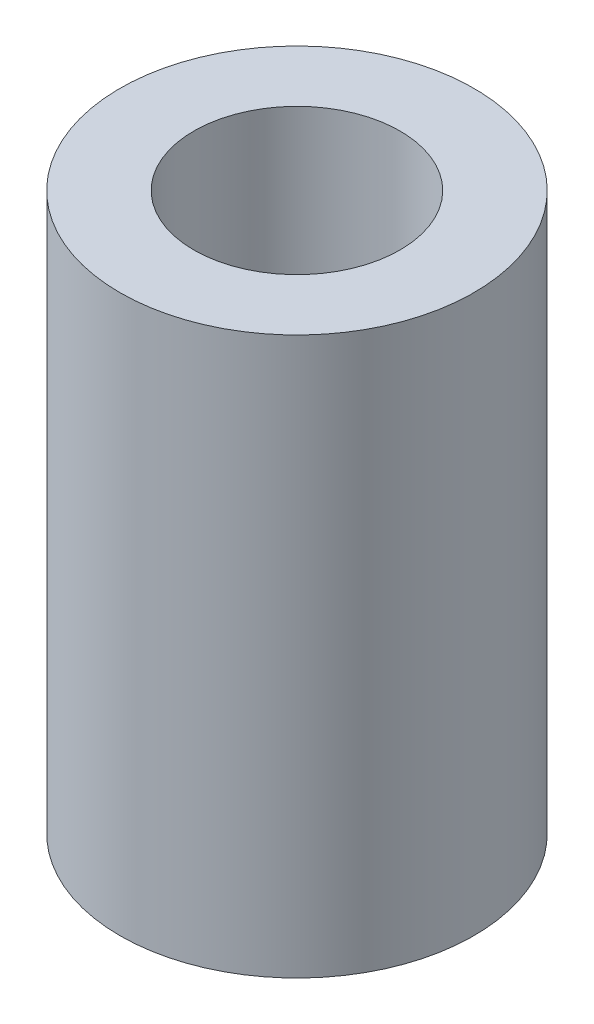
ISO-10303-21;
HEADER;
FILE_DESCRIPTION(('STEP AP214'),'2;1');
FILE_NAME('part.step','',(''),(''),'','','');
FILE_SCHEMA(('AUTOMOTIVE_DESIGN { 1 0 10303 214 1 1 1 1 }'));
ENDSEC;
DATA;
#1=APPLICATION_CONTEXT('core data for automotive mechanical design processes');
#2=APPLICATION_PROTOCOL_DEFINITION('international standard','automotive_design',2000,#1);
#3=PRODUCT_CONTEXT('',#1,'mechanical');
#4=PRODUCT('Part','Part','',(#3));
#5=PRODUCT_RELATED_PRODUCT_CATEGORY('part','',(#4));
#6=PRODUCT_DEFINITION_FORMATION('','',#4);
#7=PRODUCT_DEFINITION_CONTEXT('part definition',#1,'design');
#8=PRODUCT_DEFINITION('design','',#6,#7);
#9=PRODUCT_DEFINITION_SHAPE('','',#8);
#10=(LENGTH_UNIT() NAMED_UNIT(*) SI_UNIT(.MILLI.,.METRE.));
#11=(NAMED_UNIT(*) PLANE_ANGLE_UNIT() SI_UNIT($,.RADIAN.));
#12=(NAMED_UNIT(*) SI_UNIT($,.STERADIAN.) SOLID_ANGLE_UNIT());
#13=UNCERTAINTY_MEASURE_WITH_UNIT(LENGTH_MEASURE(1.E-05),#10,'distance_accuracy_value','');
#14=(GEOMETRIC_REPRESENTATION_CONTEXT(3) GLOBAL_UNCERTAINTY_ASSIGNED_CONTEXT((#13)) GLOBAL_UNIT_ASSIGNED_CONTEXT((#10,
#11,#12)) REPRESENTATION_CONTEXT('',''));
#15=CARTESIAN_POINT('',(0.,0.,0.));
#16=DIRECTION('',(0.,0.,1.));
#17=DIRECTION('',(1.,0.,0.));
#18=AXIS2_PLACEMENT_3D('',#15,#16,#17);
#19=CARTESIAN_POINT('',(0.,22.5,0.));
#20=DIRECTION('',(0.,1.,0.));
#21=DIRECTION('',(0.,0.,1.));
#22=AXIS2_PLACEMENT_3D('',#19,#20,#21);
#23=PLANE('',#22);
#24=CARTESIAN_POINT('',(0.,22.5,0.));
#25=DIRECTION('',(0.,1.,0.));
#26=DIRECTION('',(0.,0.,1.));
#27=AXIS2_PLACEMENT_3D('',#24,#25,#26);
#28=CIRCLE('',#27,7.1501);
#29=CARTESIAN_POINT('',(0.,22.5,7.1501));
#30=VERTEX_POINT('',#29);
#31=EDGE_CURVE('E10',#30,#30,#28,.T.);
#32=ORIENTED_EDGE('',*,*,#31,.T.);
#33=EDGE_LOOP('',(#32));
#34=FACE_BOUND('',#33,.T.);
#35=CARTESIAN_POINT('',(0.,22.5,0.));
#36=DIRECTION('',(0.,1.,0.));
#37=DIRECTION('',(0.,0.,1.));
#38=AXIS2_PLACEMENT_3D('',#35,#36,#37);
#39=CIRCLE('',#38,4.1656);
#40=CARTESIAN_POINT('',(0.,22.5,4.1656));
#41=VERTEX_POINT('',#40);
#42=EDGE_CURVE('E42',#41,#41,#39,.T.);
#43=ORIENTED_EDGE('',*,*,#42,.F.);
#44=EDGE_LOOP('',(#43));
#45=FACE_BOUND('',#44,.T.);
#46=ADVANCED_FACE('F31',(#34,#45),#23,.T.);
#47=CARTESIAN_POINT('',(0.,0.,0.));
#48=DIRECTION('',(0.,1.,0.));
#49=DIRECTION('',(0.,0.,1.));
#50=AXIS2_PLACEMENT_3D('',#47,#48,#49);
#51=PLANE('',#50);
#52=CARTESIAN_POINT('',(0.,0.,0.));
#53=DIRECTION('',(0.,1.,0.));
#54=DIRECTION('',(0.,0.,1.));
#55=AXIS2_PLACEMENT_3D('',#52,#53,#54);
#56=CIRCLE('',#55,7.1501);
#57=CARTESIAN_POINT('',(0.,0.,7.1501));
#58=VERTEX_POINT('',#57);
#59=EDGE_CURVE('E35',#58,#58,#56,.T.);
#60=ORIENTED_EDGE('',*,*,#59,.F.);
#61=EDGE_LOOP('',(#60));
#62=FACE_BOUND('',#61,.T.);
#63=CARTESIAN_POINT('',(0.,0.,0.));
#64=DIRECTION('',(0.,1.,0.));
#65=DIRECTION('',(0.,0.,1.));
#66=AXIS2_PLACEMENT_3D('',#63,#64,#65);
#67=CIRCLE('',#66,4.1656);
#68=CARTESIAN_POINT('',(0.,0.,4.1656));
#69=VERTEX_POINT('',#68);
#70=EDGE_CURVE('E44',#69,#69,#67,.T.);
#71=ORIENTED_EDGE('',*,*,#70,.T.);
#72=EDGE_LOOP('',(#71));
#73=FACE_BOUND('',#72,.T.);
#74=ADVANCED_FACE('F54',(#62,#73),#51,.F.);
#75=CARTESIAN_POINT('',(0.,22.5,0.));
#76=DIRECTION('',(0.,-1.,0.));
#77=DIRECTION('',(0.,0.,-1.));
#78=AXIS2_PLACEMENT_3D('',#75,#76,#77);
#79=CYLINDRICAL_SURFACE('',#78,7.1501);
#80=ORIENTED_EDGE('',*,*,#31,.F.);
#81=EDGE_LOOP('',(#80));
#82=FACE_BOUND('',#81,.T.);
#83=ORIENTED_EDGE('',*,*,#59,.T.);
#84=EDGE_LOOP('',(#83));
#85=FACE_BOUND('',#84,.T.);
#86=ADVANCED_FACE('F33',(#82,#85),#79,.T.);
#87=CARTESIAN_POINT('',(0.,22.5,0.));
#88=DIRECTION('',(0.,-1.,0.));
#89=DIRECTION('',(0.,0.,-1.));
#90=AXIS2_PLACEMENT_3D('',#87,#88,#89);
#91=CYLINDRICAL_SURFACE('',#90,4.1656);
#92=ORIENTED_EDGE('',*,*,#42,.T.);
#93=EDGE_LOOP('',(#92));
#94=FACE_BOUND('',#93,.T.);
#95=ORIENTED_EDGE('',*,*,#70,.F.);
#96=EDGE_LOOP('',(#95));
#97=FACE_BOUND('',#96,.T.);
#98=ADVANCED_FACE('F50',(#94,#97),#91,.F.);
#99=CLOSED_SHELL('',(#46,#74,#86,#98));
#100=MANIFOLD_SOLID_BREP('B2',#99);
#101=ADVANCED_BREP_SHAPE_REPRESENTATION('',(#18,#100),#14);
#102=SHAPE_DEFINITION_REPRESENTATION(#9,#101);
ENDSEC;
END-ISO-10303-21;
